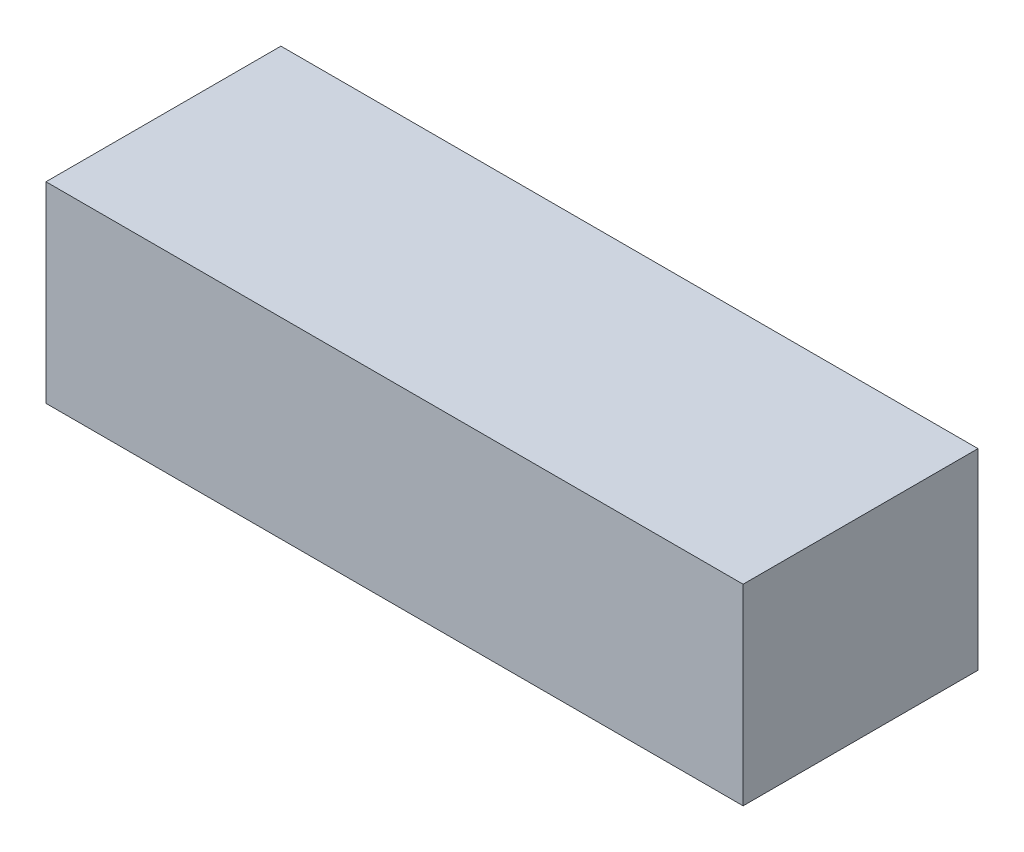
ISO-10303-21;
HEADER;
FILE_DESCRIPTION(('STEP AP214'),'2;1');
FILE_NAME('part.step','',(''),(''),'','','');
FILE_SCHEMA(('AUTOMOTIVE_DESIGN { 1 0 10303 214 1 1 1 1 }'));
ENDSEC;
DATA;
#1=APPLICATION_CONTEXT('core data for automotive mechanical design processes');
#2=APPLICATION_PROTOCOL_DEFINITION('international standard','automotive_design',2000,#1);
#3=PRODUCT_CONTEXT('',#1,'mechanical');
#4=PRODUCT('Part','Part','',(#3));
#5=PRODUCT_RELATED_PRODUCT_CATEGORY('part','',(#4));
#6=PRODUCT_DEFINITION_FORMATION('','',#4);
#7=PRODUCT_DEFINITION_CONTEXT('part definition',#1,'design');
#8=PRODUCT_DEFINITION('design','',#6,#7);
#9=PRODUCT_DEFINITION_SHAPE('','',#8);
#10=(LENGTH_UNIT() NAMED_UNIT(*) SI_UNIT(.MILLI.,.METRE.));
#11=(NAMED_UNIT(*) PLANE_ANGLE_UNIT() SI_UNIT($,.RADIAN.));
#12=(NAMED_UNIT(*) SI_UNIT($,.STERADIAN.) SOLID_ANGLE_UNIT());
#13=UNCERTAINTY_MEASURE_WITH_UNIT(LENGTH_MEASURE(1.E-05),#10,'distance_accuracy_value','');
#14=(GEOMETRIC_REPRESENTATION_CONTEXT(3) GLOBAL_UNCERTAINTY_ASSIGNED_CONTEXT((#13)) GLOBAL_UNIT_ASSIGNED_CONTEXT((#10,
#11,#12)) REPRESENTATION_CONTEXT('',''));
#15=CARTESIAN_POINT('',(0.,0.,0.));
#16=DIRECTION('',(0.,0.,1.));
#17=DIRECTION('',(1.,0.,0.));
#18=AXIS2_PLACEMENT_3D('',#15,#16,#17);
#19=CARTESIAN_POINT('',(-69.,38.,0.));
#20=DIRECTION('',(1.,0.,0.));
#21=DIRECTION('',(0.,0.,-1.));
#22=AXIS2_PLACEMENT_3D('',#19,#20,#21);
#23=PLANE('',#22);
#24=DIRECTION('',(0.,0.,1.));
#25=VECTOR('',#24,1.);
#26=CARTESIAN_POINT('',(-69.,0.,0.));
#27=LINE('',#26,#25);
#28=CARTESIAN_POINT('',(-69.,0.,-46.5));
#29=VERTEX_POINT('',#28);
#30=CARTESIAN_POINT('',(-69.,0.,0.));
#31=VERTEX_POINT('',#30);
#32=EDGE_CURVE('E111',#29,#31,#27,.T.);
#33=ORIENTED_EDGE('',*,*,#32,.T.);
#34=DIRECTION('',(0.,-1.,0.));
#35=VECTOR('',#34,1.);
#36=CARTESIAN_POINT('',(-69.,38.,0.));
#37=LINE('',#36,#35);
#38=CARTESIAN_POINT('',(-69.,38.,0.));
#39=VERTEX_POINT('',#38);
#40=EDGE_CURVE('E11',#39,#31,#37,.T.);
#41=ORIENTED_EDGE('',*,*,#40,.F.);
#42=DIRECTION('',(0.,0.,1.));
#43=VECTOR('',#42,1.);
#44=CARTESIAN_POINT('',(-69.,38.,0.));
#45=LINE('',#44,#43);
#46=CARTESIAN_POINT('',(-69.,38.,-46.5));
#47=VERTEX_POINT('',#46);
#48=EDGE_CURVE('E96',#47,#39,#45,.T.);
#49=ORIENTED_EDGE('',*,*,#48,.F.);
#50=DIRECTION('',(0.,-1.,0.));
#51=VECTOR('',#50,1.);
#52=CARTESIAN_POINT('',(-69.,38.,-46.5));
#53=LINE('',#52,#51);
#54=EDGE_CURVE('E107',#47,#29,#53,.T.);
#55=ORIENTED_EDGE('',*,*,#54,.T.);
#56=EDGE_LOOP('',(#33,#41,#49,#55));
#57=FACE_BOUND('',#56,.T.);
#58=ADVANCED_FACE('F42',(#57),#23,.F.);
#59=CARTESIAN_POINT('',(-69.,38.,0.));
#60=DIRECTION('',(0.,0.,-1.));
#61=DIRECTION('',(-1.,0.,0.));
#62=AXIS2_PLACEMENT_3D('',#59,#60,#61);
#63=PLANE('',#62);
#64=DIRECTION('',(1.,0.,0.));
#65=VECTOR('',#64,1.);
#66=CARTESIAN_POINT('',(-69.,0.,0.));
#67=LINE('',#66,#65);
#68=CARTESIAN_POINT('',(69.,0.,0.));
#69=VERTEX_POINT('',#68);
#70=EDGE_CURVE('E101',#31,#69,#67,.T.);
#71=ORIENTED_EDGE('',*,*,#70,.T.);
#72=DIRECTION('',(0.,-1.,0.));
#73=VECTOR('',#72,1.);
#74=CARTESIAN_POINT('',(69.,38.,0.));
#75=LINE('',#74,#73);
#76=CARTESIAN_POINT('',(69.,38.,0.));
#77=VERTEX_POINT('',#76);
#78=EDGE_CURVE('E51',#77,#69,#75,.T.);
#79=ORIENTED_EDGE('',*,*,#78,.F.);
#80=DIRECTION('',(1.,0.,0.));
#81=VECTOR('',#80,1.);
#82=CARTESIAN_POINT('',(-69.,38.,0.));
#83=LINE('',#82,#81);
#84=EDGE_CURVE('E91',#39,#77,#83,.T.);
#85=ORIENTED_EDGE('',*,*,#84,.F.);
#86=ORIENTED_EDGE('',*,*,#40,.T.);
#87=EDGE_LOOP('',(#71,#79,#85,#86));
#88=FACE_BOUND('',#87,.T.);
#89=ADVANCED_FACE('F100',(#88),#63,.F.);
#90=CARTESIAN_POINT('',(69.,38.,0.));
#91=DIRECTION('',(-1.,0.,0.));
#92=DIRECTION('',(0.,0.,1.));
#93=AXIS2_PLACEMENT_3D('',#90,#91,#92);
#94=PLANE('',#93);
#95=DIRECTION('',(0.,0.,-1.));
#96=VECTOR('',#95,1.);
#97=CARTESIAN_POINT('',(69.,0.,0.));
#98=LINE('',#97,#96);
#99=CARTESIAN_POINT('',(69.,0.,-46.5));
#100=VERTEX_POINT('',#99);
#101=EDGE_CURVE('E78',#69,#100,#98,.T.);
#102=ORIENTED_EDGE('',*,*,#101,.T.);
#103=DIRECTION('',(0.,-1.,0.));
#104=VECTOR('',#103,1.);
#105=CARTESIAN_POINT('',(69.,38.,-46.5));
#106=LINE('',#105,#104);
#107=CARTESIAN_POINT('',(69.,38.,-46.5));
#108=VERTEX_POINT('',#107);
#109=EDGE_CURVE('E103',#108,#100,#106,.T.);
#110=ORIENTED_EDGE('',*,*,#109,.F.);
#111=DIRECTION('',(0.,0.,-1.));
#112=VECTOR('',#111,1.);
#113=CARTESIAN_POINT('',(69.,38.,0.));
#114=LINE('',#113,#112);
#115=EDGE_CURVE('E94',#77,#108,#114,.T.);
#116=ORIENTED_EDGE('',*,*,#115,.F.);
#117=ORIENTED_EDGE('',*,*,#78,.T.);
#118=EDGE_LOOP('',(#102,#110,#116,#117));
#119=FACE_BOUND('',#118,.T.);
#120=ADVANCED_FACE('F104',(#119),#94,.F.);
#121=CARTESIAN_POINT('',(-69.,38.,-46.5));
#122=DIRECTION('',(0.,0.,1.));
#123=DIRECTION('',(1.,0.,0.));
#124=AXIS2_PLACEMENT_3D('',#121,#122,#123);
#125=PLANE('',#124);
#126=DIRECTION('',(-1.,0.,0.));
#127=VECTOR('',#126,1.);
#128=CARTESIAN_POINT('',(-69.,0.,-46.5));
#129=LINE('',#128,#127);
#130=EDGE_CURVE('E84',#100,#29,#129,.T.);
#131=ORIENTED_EDGE('',*,*,#130,.T.);
#132=ORIENTED_EDGE('',*,*,#54,.F.);
#133=DIRECTION('',(-1.,0.,0.));
#134=VECTOR('',#133,1.);
#135=CARTESIAN_POINT('',(-69.,38.,-46.5));
#136=LINE('',#135,#134);
#137=EDGE_CURVE('E59',#108,#47,#136,.T.);
#138=ORIENTED_EDGE('',*,*,#137,.F.);
#139=ORIENTED_EDGE('',*,*,#109,.T.);
#140=EDGE_LOOP('',(#131,#132,#138,#139));
#141=FACE_BOUND('',#140,.T.);
#142=ADVANCED_FACE('F122',(#141),#125,.F.);
#143=CARTESIAN_POINT('',(0.,38.,0.));
#144=DIRECTION('',(0.,-1.,0.));
#145=DIRECTION('',(0.,0.,-1.));
#146=AXIS2_PLACEMENT_3D('',#143,#144,#145);
#147=PLANE('',#146);
#148=ORIENTED_EDGE('',*,*,#48,.T.);
#149=ORIENTED_EDGE('',*,*,#84,.T.);
#150=ORIENTED_EDGE('',*,*,#115,.T.);
#151=ORIENTED_EDGE('',*,*,#137,.T.);
#152=EDGE_LOOP('',(#148,#149,#150,#151));
#153=FACE_BOUND('',#152,.T.);
#154=ADVANCED_FACE('F92',(#153),#147,.F.);
#155=CARTESIAN_POINT('',(0.,0.,0.));
#156=DIRECTION('',(0.,-1.,0.));
#157=DIRECTION('',(0.,0.,-1.));
#158=AXIS2_PLACEMENT_3D('',#155,#156,#157);
#159=PLANE('',#158);
#160=ORIENTED_EDGE('',*,*,#32,.F.);
#161=ORIENTED_EDGE('',*,*,#130,.F.);
#162=ORIENTED_EDGE('',*,*,#101,.F.);
#163=ORIENTED_EDGE('',*,*,#70,.F.);
#164=EDGE_LOOP('',(#160,#161,#162,#163));
#165=FACE_BOUND('',#164,.T.);
#166=ADVANCED_FACE('F125',(#165),#159,.T.);
#167=CLOSED_SHELL('',(#58,#89,#120,#142,#154,#166));
#168=MANIFOLD_SOLID_BREP('B2',#167);
#169=ADVANCED_BREP_SHAPE_REPRESENTATION('',(#18,#168),#14);
#170=SHAPE_DEFINITION_REPRESENTATION(#9,#169);
ENDSEC;
END-ISO-10303-21;
